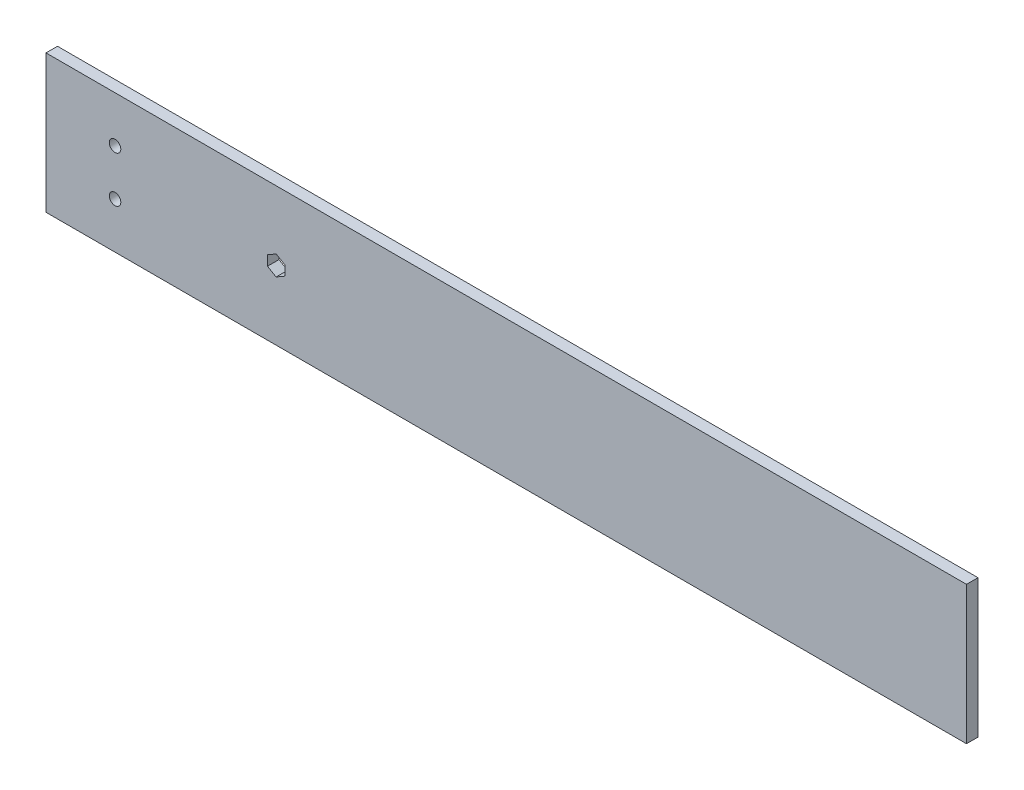
ISO-10303-21;
HEADER;
FILE_DESCRIPTION(('STEP AP214'),'2;1');
FILE_NAME('part.step','',(''),(''),'','','');
FILE_SCHEMA(('AUTOMOTIVE_DESIGN { 1 0 10303 214 1 1 1 1 }'));
ENDSEC;
DATA;
#1=APPLICATION_CONTEXT('core data for automotive mechanical design processes');
#2=APPLICATION_PROTOCOL_DEFINITION('international standard','automotive_design',2000,#1);
#3=PRODUCT_CONTEXT('',#1,'mechanical');
#4=PRODUCT('Part','Part','',(#3));
#5=PRODUCT_RELATED_PRODUCT_CATEGORY('part','',(#4));
#6=PRODUCT_DEFINITION_FORMATION('','',#4);
#7=PRODUCT_DEFINITION_CONTEXT('part definition',#1,'design');
#8=PRODUCT_DEFINITION('design','',#6,#7);
#9=PRODUCT_DEFINITION_SHAPE('','',#8);
#10=(LENGTH_UNIT() NAMED_UNIT(*) SI_UNIT(.MILLI.,.METRE.));
#11=(NAMED_UNIT(*) PLANE_ANGLE_UNIT() SI_UNIT($,.RADIAN.));
#12=(NAMED_UNIT(*) SI_UNIT($,.STERADIAN.) SOLID_ANGLE_UNIT());
#13=UNCERTAINTY_MEASURE_WITH_UNIT(LENGTH_MEASURE(1.E-05),#10,'distance_accuracy_value','');
#14=(GEOMETRIC_REPRESENTATION_CONTEXT(3) GLOBAL_UNCERTAINTY_ASSIGNED_CONTEXT((#13)) GLOBAL_UNIT_ASSIGNED_CONTEXT((#10,
#11,#12)) REPRESENTATION_CONTEXT('',''));
#15=CARTESIAN_POINT('',(0.,0.,0.));
#16=DIRECTION('',(0.,0.,1.));
#17=DIRECTION('',(1.,0.,0.));
#18=AXIS2_PLACEMENT_3D('',#15,#16,#17);
#19=CARTESIAN_POINT('',(0.,0.,6.35));
#20=DIRECTION('',(1.,0.,0.));
#21=DIRECTION('',(0.,0.,-1.));
#22=AXIS2_PLACEMENT_3D('',#19,#20,#21);
#23=PLANE('',#22);
#24=DIRECTION('',(0.,-1.,0.));
#25=VECTOR('',#24,1.);
#26=CARTESIAN_POINT('',(0.,0.,0.));
#27=LINE('',#26,#25);
#28=CARTESIAN_POINT('',(0.,76.2,0.));
#29=VERTEX_POINT('',#28);
#30=CARTESIAN_POINT('',(0.,0.,0.));
#31=VERTEX_POINT('',#30);
#32=EDGE_CURVE('E158',#29,#31,#27,.T.);
#33=ORIENTED_EDGE('',*,*,#32,.T.);
#34=DIRECTION('',(0.,0.,-1.));
#35=VECTOR('',#34,1.);
#36=CARTESIAN_POINT('',(0.,0.,6.35));
#37=LINE('',#36,#35);
#38=CARTESIAN_POINT('',(0.,0.,6.35));
#39=VERTEX_POINT('',#38);
#40=EDGE_CURVE('E11',#39,#31,#37,.T.);
#41=ORIENTED_EDGE('',*,*,#40,.F.);
#42=DIRECTION('',(0.,-1.,0.));
#43=VECTOR('',#42,1.);
#44=CARTESIAN_POINT('',(0.,0.,6.35));
#45=LINE('',#44,#43);
#46=CARTESIAN_POINT('',(0.,76.2,6.35));
#47=VERTEX_POINT('',#46);
#48=EDGE_CURVE('E166',#47,#39,#45,.T.);
#49=ORIENTED_EDGE('',*,*,#48,.F.);
#50=DIRECTION('',(0.,0.,-1.));
#51=VECTOR('',#50,1.);
#52=CARTESIAN_POINT('',(0.,76.2,6.35));
#53=LINE('',#52,#51);
#54=EDGE_CURVE('E176',#47,#29,#53,.T.);
#55=ORIENTED_EDGE('',*,*,#54,.T.);
#56=EDGE_LOOP('',(#33,#41,#49,#55));
#57=FACE_BOUND('',#56,.T.);
#58=ADVANCED_FACE('F33',(#57),#23,.F.);
#59=CARTESIAN_POINT('',(0.,0.,6.35));
#60=DIRECTION('',(0.,1.,0.));
#61=DIRECTION('',(0.,0.,1.));
#62=AXIS2_PLACEMENT_3D('',#59,#60,#61);
#63=PLANE('',#62);
#64=DIRECTION('',(1.,0.,0.));
#65=VECTOR('',#64,1.);
#66=CARTESIAN_POINT('',(0.,0.,0.));
#67=LINE('',#66,#65);
#68=CARTESIAN_POINT('',(508.,0.,0.));
#69=VERTEX_POINT('',#68);
#70=EDGE_CURVE('E179',#31,#69,#67,.T.);
#71=ORIENTED_EDGE('',*,*,#70,.T.);
#72=DIRECTION('',(0.,0.,-1.));
#73=VECTOR('',#72,1.);
#74=CARTESIAN_POINT('',(508.,0.,6.35));
#75=LINE('',#74,#73);
#76=CARTESIAN_POINT('',(508.,0.,6.35));
#77=VERTEX_POINT('',#76);
#78=EDGE_CURVE('E40',#77,#69,#75,.T.);
#79=ORIENTED_EDGE('',*,*,#78,.F.);
#80=DIRECTION('',(1.,0.,0.));
#81=VECTOR('',#80,1.);
#82=CARTESIAN_POINT('',(0.,0.,6.35));
#83=LINE('',#82,#81);
#84=EDGE_CURVE('E169',#39,#77,#83,.T.);
#85=ORIENTED_EDGE('',*,*,#84,.F.);
#86=ORIENTED_EDGE('',*,*,#40,.T.);
#87=EDGE_LOOP('',(#71,#79,#85,#86));
#88=FACE_BOUND('',#87,.T.);
#89=ADVANCED_FACE('F207',(#88),#63,.F.);
#90=CARTESIAN_POINT('',(508.,0.,6.35));
#91=DIRECTION('',(-1.,0.,0.));
#92=DIRECTION('',(0.,0.,1.));
#93=AXIS2_PLACEMENT_3D('',#90,#91,#92);
#94=PLANE('',#93);
#95=DIRECTION('',(0.,1.,0.));
#96=VECTOR('',#95,1.);
#97=CARTESIAN_POINT('',(508.,0.,0.));
#98=LINE('',#97,#96);
#99=CARTESIAN_POINT('',(508.,76.2,0.));
#100=VERTEX_POINT('',#99);
#101=EDGE_CURVE('E181',#69,#100,#98,.T.);
#102=ORIENTED_EDGE('',*,*,#101,.T.);
#103=DIRECTION('',(0.,0.,-1.));
#104=VECTOR('',#103,1.);
#105=CARTESIAN_POINT('',(508.,76.2,6.35));
#106=LINE('',#105,#104);
#107=CARTESIAN_POINT('',(508.,76.2,6.35));
#108=VERTEX_POINT('',#107);
#109=EDGE_CURVE('E186',#108,#100,#106,.T.);
#110=ORIENTED_EDGE('',*,*,#109,.F.);
#111=DIRECTION('',(0.,1.,0.));
#112=VECTOR('',#111,1.);
#113=CARTESIAN_POINT('',(508.,0.,6.35));
#114=LINE('',#113,#112);
#115=EDGE_CURVE('E172',#77,#108,#114,.T.);
#116=ORIENTED_EDGE('',*,*,#115,.F.);
#117=ORIENTED_EDGE('',*,*,#78,.T.);
#118=EDGE_LOOP('',(#102,#110,#116,#117));
#119=FACE_BOUND('',#118,.T.);
#120=ADVANCED_FACE('F193',(#119),#94,.F.);
#121=CARTESIAN_POINT('',(0.,76.2,6.35));
#122=DIRECTION('',(0.,-1.,0.));
#123=DIRECTION('',(0.,0.,-1.));
#124=AXIS2_PLACEMENT_3D('',#121,#122,#123);
#125=PLANE('',#124);
#126=DIRECTION('',(-1.,0.,0.));
#127=VECTOR('',#126,1.);
#128=CARTESIAN_POINT('',(0.,76.2,0.));
#129=LINE('',#128,#127);
#130=EDGE_CURVE('E170',#100,#29,#129,.T.);
#131=ORIENTED_EDGE('',*,*,#130,.T.);
#132=ORIENTED_EDGE('',*,*,#54,.F.);
#133=DIRECTION('',(-1.,0.,0.));
#134=VECTOR('',#133,1.);
#135=CARTESIAN_POINT('',(0.,76.2,6.35));
#136=LINE('',#135,#134);
#137=EDGE_CURVE('E174',#108,#47,#136,.T.);
#138=ORIENTED_EDGE('',*,*,#137,.F.);
#139=ORIENTED_EDGE('',*,*,#109,.T.);
#140=EDGE_LOOP('',(#131,#132,#138,#139));
#141=FACE_BOUND('',#140,.T.);
#142=ADVANCED_FACE('F200',(#141),#125,.F.);
#143=CARTESIAN_POINT('',(0.,76.2,6.35));
#144=DIRECTION('',(0.,0.,-1.));
#145=DIRECTION('',(-1.,0.,0.));
#146=AXIS2_PLACEMENT_3D('',#143,#144,#145);
#147=PLANE('',#146);
#148=CARTESIAN_POINT('',(38.1,25.4,6.35));
#149=DIRECTION('',(0.,0.,1.));
#150=DIRECTION('',(-1.,0.,0.));
#151=AXIS2_PLACEMENT_3D('',#148,#149,#150);
#152=CIRCLE('',#151,3.175);
#153=CARTESIAN_POINT('',(34.925,25.4,6.35));
#154=VERTEX_POINT('',#153);
#155=EDGE_CURVE('E257',#154,#154,#152,.T.);
#156=ORIENTED_EDGE('',*,*,#155,.F.);
#157=EDGE_LOOP('',(#156));
#158=FACE_BOUND('',#157,.T.);
#159=CARTESIAN_POINT('',(38.1,50.8,6.35));
#160=DIRECTION('',(0.,0.,1.));
#161=DIRECTION('',(1.,0.,0.));
#162=AXIS2_PLACEMENT_3D('',#159,#160,#161);
#163=CIRCLE('',#162,3.175);
#164=CARTESIAN_POINT('',(41.275,50.8,6.35));
#165=VERTEX_POINT('',#164);
#166=EDGE_CURVE('E134',#165,#165,#163,.T.);
#167=ORIENTED_EDGE('',*,*,#166,.F.);
#168=EDGE_LOOP('',(#167));
#169=FACE_BOUND('',#168,.T.);
#170=DIRECTION('',(-0.866025403784438,-0.5,0.));
#171=VECTOR('',#170,1.);
#172=CARTESIAN_POINT('',(127.,43.5991,6.35));
#173=LINE('',#172,#171);
#174=CARTESIAN_POINT('',(127.,43.5991,6.35));
#175=VERTEX_POINT('',#174);
#176=CARTESIAN_POINT('',(122.237639702049,40.84955,6.35));
#177=VERTEX_POINT('',#176);
#178=EDGE_CURVE('E145',#175,#177,#173,.T.);
#179=ORIENTED_EDGE('',*,*,#178,.F.);
#180=DIRECTION('',(-0.866025403784437,0.500000000000002,0.));
#181=VECTOR('',#180,1.);
#182=CARTESIAN_POINT('',(131.762360297951,40.84955,6.35));
#183=LINE('',#182,#181);
#184=CARTESIAN_POINT('',(131.762360297951,40.84955,6.35));
#185=VERTEX_POINT('',#184);
#186=EDGE_CURVE('E47',#185,#175,#183,.T.);
#187=ORIENTED_EDGE('',*,*,#186,.F.);
#188=DIRECTION('',(0.,1.,0.));
#189=VECTOR('',#188,1.);
#190=CARTESIAN_POINT('',(131.762360297951,35.35045,6.35));
#191=LINE('',#190,#189);
#192=CARTESIAN_POINT('',(131.762360297951,35.35045,6.35));
#193=VERTEX_POINT('',#192);
#194=EDGE_CURVE('E128',#193,#185,#191,.T.);
#195=ORIENTED_EDGE('',*,*,#194,.F.);
#196=DIRECTION('',(0.866025403784437,0.500000000000003,0.));
#197=VECTOR('',#196,1.);
#198=CARTESIAN_POINT('',(127.,32.6009,6.35));
#199=LINE('',#198,#197);
#200=CARTESIAN_POINT('',(127.,32.6009,6.35));
#201=VERTEX_POINT('',#200);
#202=EDGE_CURVE('E131',#201,#193,#199,.T.);
#203=ORIENTED_EDGE('',*,*,#202,.F.);
#204=DIRECTION('',(0.866025403784439,-0.5,0.));
#205=VECTOR('',#204,1.);
#206=CARTESIAN_POINT('',(122.237639702049,35.35045,6.35));
#207=LINE('',#206,#205);
#208=CARTESIAN_POINT('',(122.237639702049,35.35045,6.35));
#209=VERTEX_POINT('',#208);
#210=EDGE_CURVE('E151',#209,#201,#207,.T.);
#211=ORIENTED_EDGE('',*,*,#210,.F.);
#212=DIRECTION('',(0.,-1.,0.));
#213=VECTOR('',#212,1.);
#214=CARTESIAN_POINT('',(122.237639702049,40.84955,6.35));
#215=LINE('',#214,#213);
#216=EDGE_CURVE('E148',#177,#209,#215,.T.);
#217=ORIENTED_EDGE('',*,*,#216,.F.);
#218=EDGE_LOOP('',(#179,#187,#195,#203,#211,#217));
#219=FACE_BOUND('',#218,.T.);
#220=ORIENTED_EDGE('',*,*,#48,.T.);
#221=ORIENTED_EDGE('',*,*,#84,.T.);
#222=ORIENTED_EDGE('',*,*,#115,.T.);
#223=ORIENTED_EDGE('',*,*,#137,.T.);
#224=EDGE_LOOP('',(#220,#221,#222,#223));
#225=FACE_BOUND('',#224,.T.);
#226=ADVANCED_FACE('F206',(#158,#169,#219,#225),#147,.F.);
#227=CARTESIAN_POINT('',(0.,76.2,0.));
#228=DIRECTION('',(0.,0.,-1.));
#229=DIRECTION('',(-1.,0.,0.));
#230=AXIS2_PLACEMENT_3D('',#227,#228,#229);
#231=PLANE('',#230);
#232=CARTESIAN_POINT('',(38.1,25.4,0.));
#233=DIRECTION('',(0.,0.,1.));
#234=DIRECTION('',(-1.,0.,0.));
#235=AXIS2_PLACEMENT_3D('',#232,#233,#234);
#236=CIRCLE('',#235,3.175);
#237=CARTESIAN_POINT('',(34.925,25.4,0.));
#238=VERTEX_POINT('',#237);
#239=EDGE_CURVE('E254',#238,#238,#236,.T.);
#240=ORIENTED_EDGE('',*,*,#239,.T.);
#241=EDGE_LOOP('',(#240));
#242=FACE_BOUND('',#241,.T.);
#243=CARTESIAN_POINT('',(38.1,50.8,0.));
#244=DIRECTION('',(0.,0.,1.));
#245=DIRECTION('',(1.,0.,0.));
#246=AXIS2_PLACEMENT_3D('',#243,#244,#245);
#247=CIRCLE('',#246,3.175);
#248=CARTESIAN_POINT('',(41.275,50.8,0.));
#249=VERTEX_POINT('',#248);
#250=EDGE_CURVE('E146',#249,#249,#247,.T.);
#251=ORIENTED_EDGE('',*,*,#250,.T.);
#252=EDGE_LOOP('',(#251));
#253=FACE_BOUND('',#252,.T.);
#254=DIRECTION('',(-0.866025403784437,0.500000000000002,0.));
#255=VECTOR('',#254,1.);
#256=CARTESIAN_POINT('',(131.762360297951,40.84955,0.));
#257=LINE('',#256,#255);
#258=CARTESIAN_POINT('',(131.762360297951,40.84955,0.));
#259=VERTEX_POINT('',#258);
#260=CARTESIAN_POINT('',(127.,43.5991,0.));
#261=VERTEX_POINT('',#260);
#262=EDGE_CURVE('E111',#259,#261,#257,.T.);
#263=ORIENTED_EDGE('',*,*,#262,.T.);
#264=DIRECTION('',(-0.866025403784438,-0.5,0.));
#265=VECTOR('',#264,1.);
#266=CARTESIAN_POINT('',(127.,43.5991,0.));
#267=LINE('',#266,#265);
#268=CARTESIAN_POINT('',(122.237639702049,40.84955,0.));
#269=VERTEX_POINT('',#268);
#270=EDGE_CURVE('E120',#261,#269,#267,.T.);
#271=ORIENTED_EDGE('',*,*,#270,.T.);
#272=DIRECTION('',(0.,-1.,0.));
#273=VECTOR('',#272,1.);
#274=CARTESIAN_POINT('',(122.237639702049,40.84955,0.));
#275=LINE('',#274,#273);
#276=CARTESIAN_POINT('',(122.237639702049,35.35045,0.));
#277=VERTEX_POINT('',#276);
#278=EDGE_CURVE('E55',#269,#277,#275,.T.);
#279=ORIENTED_EDGE('',*,*,#278,.T.);
#280=DIRECTION('',(0.866025403784439,-0.5,0.));
#281=VECTOR('',#280,1.);
#282=CARTESIAN_POINT('',(122.237639702049,35.35045,0.));
#283=LINE('',#282,#281);
#284=CARTESIAN_POINT('',(127.,32.6009,0.));
#285=VERTEX_POINT('',#284);
#286=EDGE_CURVE('E138',#277,#285,#283,.T.);
#287=ORIENTED_EDGE('',*,*,#286,.T.);
#288=DIRECTION('',(0.866025403784437,0.500000000000003,0.));
#289=VECTOR('',#288,1.);
#290=CARTESIAN_POINT('',(127.,32.6009,0.));
#291=LINE('',#290,#289);
#292=CARTESIAN_POINT('',(131.762360297951,35.35045,0.));
#293=VERTEX_POINT('',#292);
#294=EDGE_CURVE('E141',#285,#293,#291,.T.);
#295=ORIENTED_EDGE('',*,*,#294,.T.);
#296=DIRECTION('',(0.,1.,0.));
#297=VECTOR('',#296,1.);
#298=CARTESIAN_POINT('',(131.762360297951,35.35045,0.));
#299=LINE('',#298,#297);
#300=EDGE_CURVE('E117',#293,#259,#299,.T.);
#301=ORIENTED_EDGE('',*,*,#300,.T.);
#302=EDGE_LOOP('',(#263,#271,#279,#287,#295,#301));
#303=FACE_BOUND('',#302,.T.);
#304=ORIENTED_EDGE('',*,*,#32,.F.);
#305=ORIENTED_EDGE('',*,*,#130,.F.);
#306=ORIENTED_EDGE('',*,*,#101,.F.);
#307=ORIENTED_EDGE('',*,*,#70,.F.);
#308=EDGE_LOOP('',(#304,#305,#306,#307));
#309=FACE_BOUND('',#308,.T.);
#310=ADVANCED_FACE('F124',(#242,#253,#303,#309),#231,.T.);
#311=CARTESIAN_POINT('',(131.762360297951,40.84955,0.));
#312=DIRECTION('',(0.500000000000002,0.866025403784437,0.));
#313=DIRECTION('',(-0.866025403784437,0.500000000000002,0.));
#314=AXIS2_PLACEMENT_3D('',#311,#312,#313);
#315=PLANE('',#314);
#316=ORIENTED_EDGE('',*,*,#186,.T.);
#317=DIRECTION('',(0.,0.,1.));
#318=VECTOR('',#317,1.);
#319=CARTESIAN_POINT('',(127.,43.5991,0.));
#320=LINE('',#319,#318);
#321=EDGE_CURVE('E107',#261,#175,#320,.T.);
#322=ORIENTED_EDGE('',*,*,#321,.F.);
#323=ORIENTED_EDGE('',*,*,#262,.F.);
#324=DIRECTION('',(0.,0.,1.));
#325=VECTOR('',#324,1.);
#326=CARTESIAN_POINT('',(131.762360297951,40.84955,0.));
#327=LINE('',#326,#325);
#328=EDGE_CURVE('E156',#259,#185,#327,.T.);
#329=ORIENTED_EDGE('',*,*,#328,.T.);
#330=EDGE_LOOP('',(#316,#322,#323,#329));
#331=FACE_BOUND('',#330,.T.);
#332=ADVANCED_FACE('F109',(#331),#315,.F.);
#333=CARTESIAN_POINT('',(131.762360297951,35.35045,0.));
#334=DIRECTION('',(1.,0.,0.));
#335=DIRECTION('',(0.,1.,0.));
#336=AXIS2_PLACEMENT_3D('',#333,#334,#335);
#337=PLANE('',#336);
#338=ORIENTED_EDGE('',*,*,#194,.T.);
#339=ORIENTED_EDGE('',*,*,#328,.F.);
#340=ORIENTED_EDGE('',*,*,#300,.F.);
#341=DIRECTION('',(0.,0.,1.));
#342=VECTOR('',#341,1.);
#343=CARTESIAN_POINT('',(131.762360297951,35.35045,0.));
#344=LINE('',#343,#342);
#345=EDGE_CURVE('E159',#293,#193,#344,.T.);
#346=ORIENTED_EDGE('',*,*,#345,.T.);
#347=EDGE_LOOP('',(#338,#339,#340,#346));
#348=FACE_BOUND('',#347,.T.);
#349=ADVANCED_FACE('F225',(#348),#337,.F.);
#350=CARTESIAN_POINT('',(127.,32.6009,0.));
#351=DIRECTION('',(0.500000000000003,-0.866025403784437,0.));
#352=DIRECTION('',(0.866025403784437,0.500000000000003,0.));
#353=AXIS2_PLACEMENT_3D('',#350,#351,#352);
#354=PLANE('',#353);
#355=ORIENTED_EDGE('',*,*,#202,.T.);
#356=ORIENTED_EDGE('',*,*,#345,.F.);
#357=ORIENTED_EDGE('',*,*,#294,.F.);
#358=DIRECTION('',(0.,0.,1.));
#359=VECTOR('',#358,1.);
#360=CARTESIAN_POINT('',(127.,32.6009,0.));
#361=LINE('',#360,#359);
#362=EDGE_CURVE('E161',#285,#201,#361,.T.);
#363=ORIENTED_EDGE('',*,*,#362,.T.);
#364=EDGE_LOOP('',(#355,#356,#357,#363));
#365=FACE_BOUND('',#364,.T.);
#366=ADVANCED_FACE('F235',(#365),#354,.F.);
#367=CARTESIAN_POINT('',(122.237639702049,35.35045,0.));
#368=DIRECTION('',(-0.5,-0.866025403784439,0.));
#369=DIRECTION('',(0.866025403784439,-0.5,0.));
#370=AXIS2_PLACEMENT_3D('',#367,#368,#369);
#371=PLANE('',#370);
#372=ORIENTED_EDGE('',*,*,#210,.T.);
#373=ORIENTED_EDGE('',*,*,#362,.F.);
#374=ORIENTED_EDGE('',*,*,#286,.F.);
#375=DIRECTION('',(0.,0.,1.));
#376=VECTOR('',#375,1.);
#377=CARTESIAN_POINT('',(122.237639702049,35.35045,0.));
#378=LINE('',#377,#376);
#379=EDGE_CURVE('E163',#277,#209,#378,.T.);
#380=ORIENTED_EDGE('',*,*,#379,.T.);
#381=EDGE_LOOP('',(#372,#373,#374,#380));
#382=FACE_BOUND('',#381,.T.);
#383=ADVANCED_FACE('F232',(#382),#371,.F.);
#384=CARTESIAN_POINT('',(122.237639702049,40.84955,0.));
#385=DIRECTION('',(-1.,0.,0.));
#386=DIRECTION('',(0.,0.,1.));
#387=AXIS2_PLACEMENT_3D('',#384,#385,#386);
#388=PLANE('',#387);
#389=ORIENTED_EDGE('',*,*,#216,.T.);
#390=ORIENTED_EDGE('',*,*,#379,.F.);
#391=ORIENTED_EDGE('',*,*,#278,.F.);
#392=DIRECTION('',(0.,0.,1.));
#393=VECTOR('',#392,1.);
#394=CARTESIAN_POINT('',(122.237639702049,40.84955,0.));
#395=LINE('',#394,#393);
#396=EDGE_CURVE('E116',#269,#177,#395,.T.);
#397=ORIENTED_EDGE('',*,*,#396,.T.);
#398=EDGE_LOOP('',(#389,#390,#391,#397));
#399=FACE_BOUND('',#398,.T.);
#400=ADVANCED_FACE('F229',(#399),#388,.F.);
#401=CARTESIAN_POINT('',(127.,43.5991,0.));
#402=DIRECTION('',(-0.5,0.866025403784438,0.));
#403=DIRECTION('',(-0.866025403784438,-0.500000000000001,0.));
#404=AXIS2_PLACEMENT_3D('',#401,#402,#403);
#405=PLANE('',#404);
#406=ORIENTED_EDGE('',*,*,#178,.T.);
#407=ORIENTED_EDGE('',*,*,#396,.F.);
#408=ORIENTED_EDGE('',*,*,#270,.F.);
#409=ORIENTED_EDGE('',*,*,#321,.T.);
#410=EDGE_LOOP('',(#406,#407,#408,#409));
#411=FACE_BOUND('',#410,.T.);
#412=ADVANCED_FACE('F121',(#411),#405,.F.);
#413=CARTESIAN_POINT('',(38.1,50.8,0.));
#414=DIRECTION('',(0.,0.,1.));
#415=DIRECTION('',(1.,0.,0.));
#416=AXIS2_PLACEMENT_3D('',#413,#414,#415);
#417=CYLINDRICAL_SURFACE('',#416,3.175);
#418=ORIENTED_EDGE('',*,*,#250,.F.);
#419=EDGE_LOOP('',(#418));
#420=FACE_BOUND('',#419,.T.);
#421=ORIENTED_EDGE('',*,*,#166,.T.);
#422=EDGE_LOOP('',(#421));
#423=FACE_BOUND('',#422,.T.);
#424=ADVANCED_FACE('F228',(#420,#423),#417,.F.);
#425=CARTESIAN_POINT('',(38.1,25.4,0.));
#426=DIRECTION('',(0.,0.,1.));
#427=DIRECTION('',(1.,0.,0.));
#428=AXIS2_PLACEMENT_3D('',#425,#426,#427);
#429=CYLINDRICAL_SURFACE('',#428,3.175);
#430=ORIENTED_EDGE('',*,*,#239,.F.);
#431=EDGE_LOOP('',(#430));
#432=FACE_BOUND('',#431,.T.);
#433=ORIENTED_EDGE('',*,*,#155,.T.);
#434=EDGE_LOOP('',(#433));
#435=FACE_BOUND('',#434,.T.);
#436=ADVANCED_FACE('F245',(#432,#435),#429,.F.);
#437=CLOSED_SHELL('',(#58,#89,#120,#142,#226,#310,#332,#349,#366,#383,#400,#412,#424,#436));
#438=MANIFOLD_SOLID_BREP('B2',#437);
#439=ADVANCED_BREP_SHAPE_REPRESENTATION('',(#18,#438),#14);
#440=SHAPE_DEFINITION_REPRESENTATION(#9,#439);
ENDSEC;
END-ISO-10303-21;
